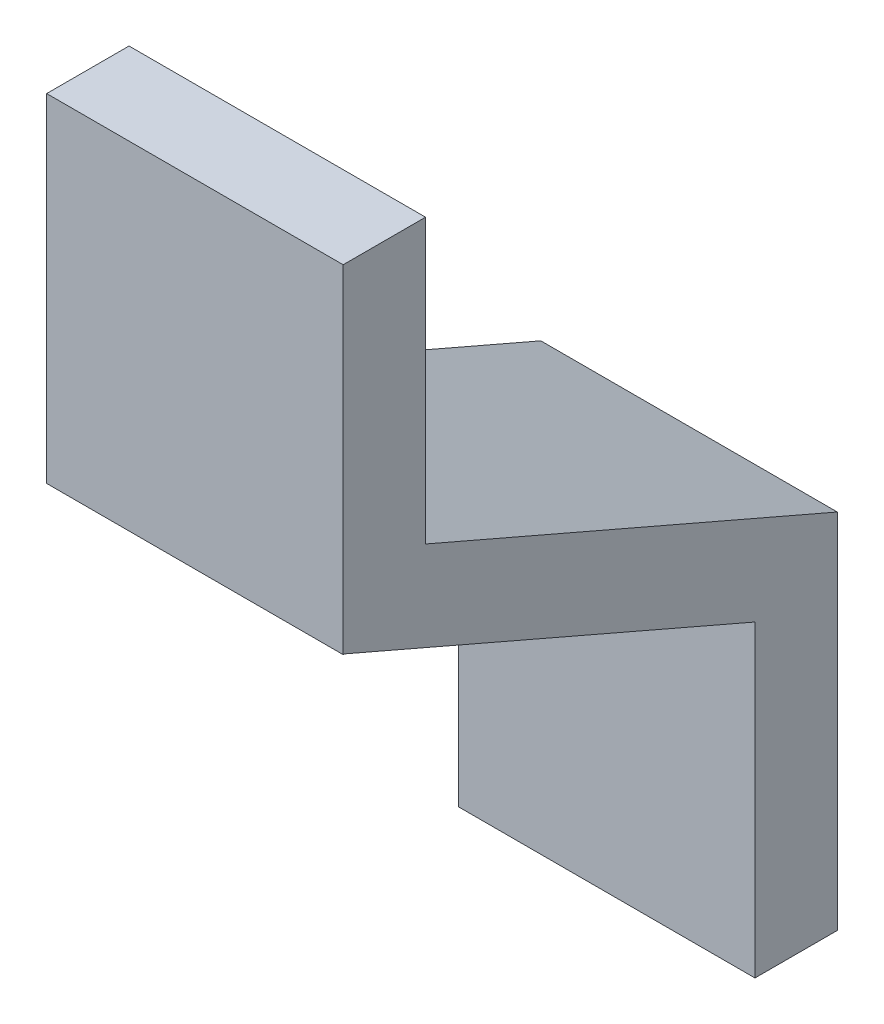
ISO-10303-21;
HEADER;
FILE_DESCRIPTION(('STEP AP214'),'2;1');
FILE_NAME('part.step','',(''),(''),'','','');
FILE_SCHEMA(('AUTOMOTIVE_DESIGN { 1 0 10303 214 1 1 1 1 }'));
ENDSEC;
DATA;
#1=APPLICATION_CONTEXT('core data for automotive mechanical design processes');
#2=APPLICATION_PROTOCOL_DEFINITION('international standard','automotive_design',2000,#1);
#3=PRODUCT_CONTEXT('',#1,'mechanical');
#4=PRODUCT('Part','Part','',(#3));
#5=PRODUCT_RELATED_PRODUCT_CATEGORY('part','',(#4));
#6=PRODUCT_DEFINITION_FORMATION('','',#4);
#7=PRODUCT_DEFINITION_CONTEXT('part definition',#1,'design');
#8=PRODUCT_DEFINITION('design','',#6,#7);
#9=PRODUCT_DEFINITION_SHAPE('','',#8);
#10=(LENGTH_UNIT() NAMED_UNIT(*) SI_UNIT(.MILLI.,.METRE.));
#11=(NAMED_UNIT(*) PLANE_ANGLE_UNIT() SI_UNIT($,.RADIAN.));
#12=(NAMED_UNIT(*) SI_UNIT($,.STERADIAN.) SOLID_ANGLE_UNIT());
#13=UNCERTAINTY_MEASURE_WITH_UNIT(LENGTH_MEASURE(1.E-05),#10,'distance_accuracy_value','');
#14=(GEOMETRIC_REPRESENTATION_CONTEXT(3) GLOBAL_UNCERTAINTY_ASSIGNED_CONTEXT((#13)) GLOBAL_UNIT_ASSIGNED_CONTEXT((#10,
#11,#12)) REPRESENTATION_CONTEXT('',''));
#15=CARTESIAN_POINT('',(0.,0.,0.));
#16=DIRECTION('',(0.,0.,1.));
#17=DIRECTION('',(1.,0.,0.));
#18=AXIS2_PLACEMENT_3D('',#15,#16,#17);
#19=CARTESIAN_POINT('',(2.62,0.999999996424,0.5));
#20=DIRECTION('',(0.,1.,0.));
#21=DIRECTION('',(0.,0.,1.));
#22=AXIS2_PLACEMENT_3D('',#19,#20,#21);
#23=PLANE('',#22);
#24=DIRECTION('',(1.,0.,0.));
#25=VECTOR('',#24,1.);
#26=CARTESIAN_POINT('',(2.62,0.999999996424,0.5));
#27=LINE('',#26,#25);
#28=CARTESIAN_POINT('',(2.980000014305,0.999999996424,0.5));
#29=VERTEX_POINT('',#28);
#30=CARTESIAN_POINT('',(2.62,0.999999996424,0.5));
#31=VERTEX_POINT('',#30);
#32=EDGE_CURVE('E140',#29,#31,#27,.F.);
#33=ORIENTED_EDGE('',*,*,#32,.T.);
#34=DIRECTION('',(0.,0.,-1.));
#35=VECTOR('',#34,1.);
#36=CARTESIAN_POINT('',(2.62,0.999999996424,0.));
#37=LINE('',#36,#35);
#38=CARTESIAN_POINT('',(2.62,0.999999996424,0.60000000149));
#39=VERTEX_POINT('',#38);
#40=EDGE_CURVE('E133',#31,#39,#37,.F.);
#41=ORIENTED_EDGE('',*,*,#40,.T.);
#42=DIRECTION('',(1.,0.,0.));
#43=VECTOR('',#42,1.);
#44=CARTESIAN_POINT('',(2.62,0.999999996424,0.60000000149));
#45=LINE('',#44,#43);
#46=CARTESIAN_POINT('',(2.980000014305,0.999999996424,0.60000000149));
#47=VERTEX_POINT('',#46);
#48=EDGE_CURVE('E129',#47,#39,#45,.F.);
#49=ORIENTED_EDGE('',*,*,#48,.F.);
#50=DIRECTION('',(0.,0.,-1.));
#51=VECTOR('',#50,1.);
#52=CARTESIAN_POINT('',(2.980000014305,0.999999996424,0.));
#53=LINE('',#52,#51);
#54=EDGE_CURVE('E106',#29,#47,#53,.F.);
#55=ORIENTED_EDGE('',*,*,#54,.F.);
#56=EDGE_LOOP('',(#33,#41,#49,#55));
#57=FACE_BOUND('',#56,.T.);
#58=ADVANCED_FACE('F17',(#57),#23,.T.);
#59=CARTESIAN_POINT('',(2.62,0.59,0.60000000149));
#60=DIRECTION('',(0.,0.,1.));
#61=DIRECTION('',(1.,0.,0.));
#62=AXIS2_PLACEMENT_3D('',#59,#60,#61);
#63=PLANE('',#62);
#64=DIRECTION('',(0.,1.,0.));
#65=VECTOR('',#64,1.);
#66=CARTESIAN_POINT('',(2.62,0.44,0.60000000149));
#67=LINE('',#66,#65);
#68=CARTESIAN_POINT('',(2.62,0.59,0.60000000149));
#69=VERTEX_POINT('',#68);
#70=EDGE_CURVE('E136',#39,#69,#67,.F.);
#71=ORIENTED_EDGE('',*,*,#70,.T.);
#72=DIRECTION('',(1.,0.,0.));
#73=VECTOR('',#72,1.);
#74=CARTESIAN_POINT('',(2.62,0.59,0.60000000149));
#75=LINE('',#74,#73);
#76=CARTESIAN_POINT('',(2.980000014305,0.59,0.60000000149));
#77=VERTEX_POINT('',#76);
#78=EDGE_CURVE('E92',#69,#77,#75,.T.);
#79=ORIENTED_EDGE('',*,*,#78,.T.);
#80=DIRECTION('',(0.,1.,0.));
#81=VECTOR('',#80,1.);
#82=CARTESIAN_POINT('',(2.980000014305,0.44,0.60000000149));
#83=LINE('',#82,#81);
#84=EDGE_CURVE('E73',#47,#77,#83,.F.);
#85=ORIENTED_EDGE('',*,*,#84,.F.);
#86=ORIENTED_EDGE('',*,*,#48,.T.);
#87=EDGE_LOOP('',(#71,#79,#85,#86));
#88=FACE_BOUND('',#87,.T.);
#89=ADVANCED_FACE('F285',(#88),#63,.T.);
#90=CARTESIAN_POINT('',(2.62,0.59,0.5));
#91=DIRECTION('',(0.,1.,0.));
#92=DIRECTION('',(0.,0.,1.));
#93=AXIS2_PLACEMENT_3D('',#90,#91,#92);
#94=PLANE('',#93);
#95=DIRECTION('',(1.,0.,0.));
#96=VECTOR('',#95,1.);
#97=CARTESIAN_POINT('',(2.62,0.590000000000416,0.59842599626982));
#98=LINE('',#97,#96);
#99=CARTESIAN_POINT('',(2.980000014305,0.590000000000104,0.598425996269911));
#100=VERTEX_POINT('',#99);
#101=CARTESIAN_POINT('',(2.62,0.590000000000104,0.59842599626991));
#102=VERTEX_POINT('',#101);
#103=EDGE_CURVE('E84',#100,#102,#98,.F.);
#104=ORIENTED_EDGE('',*,*,#103,.F.);
#105=DIRECTION('',(0.,0.,-1.));
#106=VECTOR('',#105,1.);
#107=CARTESIAN_POINT('',(2.980000014305,0.59,0.));
#108=LINE('',#107,#106);
#109=EDGE_CURVE('E20',#77,#100,#108,.T.);
#110=ORIENTED_EDGE('',*,*,#109,.F.);
#111=ORIENTED_EDGE('',*,*,#78,.F.);
#112=DIRECTION('',(0.,0.,1.));
#113=VECTOR('',#112,1.);
#114=CARTESIAN_POINT('',(2.62,0.59,0.5));
#115=LINE('',#114,#113);
#116=EDGE_CURVE('E87',#69,#102,#115,.F.);
#117=ORIENTED_EDGE('',*,*,#116,.T.);
#118=EDGE_LOOP('',(#104,#110,#111,#117));
#119=FACE_BOUND('',#118,.T.);
#120=ADVANCED_FACE('F85',(#119),#94,.F.);
#121=CARTESIAN_POINT('',(2.62,0.348224508223,0.03971472531736));
#122=DIRECTION('',(0.,-0.917754904098641,0.397147247255844));
#123=DIRECTION('',(0.,-0.397147247255844,-0.917754904098641));
#124=AXIS2_PLACEMENT_3D('',#121,#122,#123);
#125=PLANE('',#124);
#126=DIRECTION('',(0.,-0.397147247255413,-0.917754904098827));
#127=VECTOR('',#126,1.);
#128=CARTESIAN_POINT('',(2.980000014305,0.59,0.59842599627));
#129=LINE('',#128,#127);
#130=CARTESIAN_POINT('',(2.980000014305,0.37431222660502,0.10000000149));
#131=VERTEX_POINT('',#130);
#132=EDGE_CURVE('E80',#100,#131,#129,.T.);
#133=ORIENTED_EDGE('',*,*,#132,.F.);
#134=ORIENTED_EDGE('',*,*,#103,.T.);
#135=DIRECTION('',(0.,-0.397147247255413,-0.917754904098827));
#136=VECTOR('',#135,1.);
#137=CARTESIAN_POINT('',(2.62,0.59,0.59842599627));
#138=LINE('',#137,#136);
#139=CARTESIAN_POINT('',(2.62,0.374312226605,0.10000000149));
#140=VERTEX_POINT('',#139);
#141=EDGE_CURVE('E122',#102,#140,#138,.T.);
#142=ORIENTED_EDGE('',*,*,#141,.T.);
#143=DIRECTION('',(1.,0.,0.));
#144=VECTOR('',#143,1.);
#145=CARTESIAN_POINT('',(2.62,0.374312226605,0.10000000149));
#146=LINE('',#145,#144);
#147=EDGE_CURVE('E91',#131,#140,#146,.F.);
#148=ORIENTED_EDGE('',*,*,#147,.F.);
#149=EDGE_LOOP('',(#133,#134,#142,#148));
#150=FACE_BOUND('',#149,.T.);
#151=ADVANCED_FACE('F94',(#150),#125,.T.);
#152=CARTESIAN_POINT('',(2.62,0.,0.10000000149));
#153=DIRECTION('',(0.,0.,1.));
#154=DIRECTION('',(1.,0.,0.));
#155=AXIS2_PLACEMENT_3D('',#152,#153,#154);
#156=PLANE('',#155);
#157=ORIENTED_EDGE('',*,*,#147,.T.);
#158=DIRECTION('',(0.,1.,0.));
#159=VECTOR('',#158,1.);
#160=CARTESIAN_POINT('',(2.62,0.44,0.10000000149));
#161=LINE('',#160,#159);
#162=CARTESIAN_POINT('',(2.62,0.,0.10000000149));
#163=VERTEX_POINT('',#162);
#164=EDGE_CURVE('E118',#140,#163,#161,.F.);
#165=ORIENTED_EDGE('',*,*,#164,.T.);
#166=DIRECTION('',(1.,0.,0.));
#167=VECTOR('',#166,1.);
#168=CARTESIAN_POINT('',(2.62,0.,0.10000000149));
#169=LINE('',#168,#167);
#170=CARTESIAN_POINT('',(2.980000014305,0.,0.10000000149));
#171=VERTEX_POINT('',#170);
#172=EDGE_CURVE('E115',#163,#171,#169,.T.);
#173=ORIENTED_EDGE('',*,*,#172,.T.);
#174=DIRECTION('',(0.,1.,0.));
#175=VECTOR('',#174,1.);
#176=CARTESIAN_POINT('',(2.980000014305,0.44,0.10000000149));
#177=LINE('',#176,#175);
#178=EDGE_CURVE('E96',#131,#171,#177,.F.);
#179=ORIENTED_EDGE('',*,*,#178,.F.);
#180=EDGE_LOOP('',(#157,#165,#173,#179));
#181=FACE_BOUND('',#180,.T.);
#182=ADVANCED_FACE('F202',(#181),#156,.T.);
#183=CARTESIAN_POINT('',(2.62,0.,0.));
#184=DIRECTION('',(0.,1.,0.));
#185=DIRECTION('',(0.,0.,1.));
#186=AXIS2_PLACEMENT_3D('',#183,#184,#185);
#187=PLANE('',#186);
#188=DIRECTION('',(0.,0.,-1.));
#189=VECTOR('',#188,1.);
#190=CARTESIAN_POINT('',(2.62,0.,0.));
#191=LINE('',#190,#189);
#192=CARTESIAN_POINT('',(2.62,0.,0.));
#193=VERTEX_POINT('',#192);
#194=EDGE_CURVE('E121',#163,#193,#191,.T.);
#195=ORIENTED_EDGE('',*,*,#194,.T.);
#196=DIRECTION('',(1.,0.,0.));
#197=VECTOR('',#196,1.);
#198=CARTESIAN_POINT('',(2.62,0.,0.));
#199=LINE('',#198,#197);
#200=CARTESIAN_POINT('',(2.980000014305,0.,0.));
#201=VERTEX_POINT('',#200);
#202=EDGE_CURVE('E112',#193,#201,#199,.T.);
#203=ORIENTED_EDGE('',*,*,#202,.T.);
#204=DIRECTION('',(0.,0.,-1.));
#205=VECTOR('',#204,1.);
#206=CARTESIAN_POINT('',(2.980000014305,0.,0.));
#207=LINE('',#206,#205);
#208=EDGE_CURVE('E98',#171,#201,#207,.T.);
#209=ORIENTED_EDGE('',*,*,#208,.F.);
#210=ORIENTED_EDGE('',*,*,#172,.F.);
#211=EDGE_LOOP('',(#195,#203,#209,#210));
#212=FACE_BOUND('',#211,.T.);
#213=ADVANCED_FACE('F206',(#212),#187,.F.);
#214=CARTESIAN_POINT('',(2.62,0.,0.));
#215=DIRECTION('',(0.,0.,1.));
#216=DIRECTION('',(1.,0.,0.));
#217=AXIS2_PLACEMENT_3D('',#214,#215,#216);
#218=PLANE('',#217);
#219=ORIENTED_EDGE('',*,*,#202,.F.);
#220=DIRECTION('',(0.,1.,0.));
#221=VECTOR('',#220,1.);
#222=CARTESIAN_POINT('',(2.62,0.44,0.));
#223=LINE('',#222,#221);
#224=CARTESIAN_POINT('',(2.62,0.439999998997445,-1.94673175919965E-10));
#225=VERTEX_POINT('',#224);
#226=EDGE_CURVE('E178',#193,#225,#223,.T.);
#227=ORIENTED_EDGE('',*,*,#226,.T.);
#228=DIRECTION('',(1.,0.,0.));
#229=VECTOR('',#228,1.);
#230=CARTESIAN_POINT('',(2.62,0.43999999966303,-7.78692710220355E-10));
#231=LINE('',#230,#229);
#232=CARTESIAN_POINT('',(2.980000014305,0.439999998997445,-1.94673175919965E-10));
#233=VERTEX_POINT('',#232);
#234=EDGE_CURVE('E163',#225,#233,#231,.T.);
#235=ORIENTED_EDGE('',*,*,#234,.T.);
#236=DIRECTION('',(0.,1.,0.));
#237=VECTOR('',#236,1.);
#238=CARTESIAN_POINT('',(2.980000014305,0.44,0.));
#239=LINE('',#238,#237);
#240=EDGE_CURVE('E109',#201,#233,#239,.T.);
#241=ORIENTED_EDGE('',*,*,#240,.F.);
#242=EDGE_LOOP('',(#219,#227,#235,#241));
#243=FACE_BOUND('',#242,.T.);
#244=ADVANCED_FACE('F186',(#243),#218,.F.);
#245=CARTESIAN_POINT('',(2.980000014305,0.44,0.));
#246=DIRECTION('',(1.,0.,0.));
#247=DIRECTION('',(0.,0.,-1.));
#248=AXIS2_PLACEMENT_3D('',#245,#246,#247);
#249=PLANE('',#248);
#250=ORIENTED_EDGE('',*,*,#178,.T.);
#251=ORIENTED_EDGE('',*,*,#208,.T.);
#252=ORIENTED_EDGE('',*,*,#240,.T.);
#253=DIRECTION('',(0.,-0.397147247255844,-0.917754904098641));
#254=VECTOR('',#253,1.);
#255=CARTESIAN_POINT('',(2.980000014305,0.44,0.));
#256=LINE('',#255,#254);
#257=CARTESIAN_POINT('',(2.980000014305,0.656368904967003,0.499999999999999));
#258=VERTEX_POINT('',#257);
#259=EDGE_CURVE('E151',#233,#258,#256,.F.);
#260=ORIENTED_EDGE('',*,*,#259,.T.);
#261=DIRECTION('',(0.,1.,0.));
#262=VECTOR('',#261,1.);
#263=CARTESIAN_POINT('',(2.980000014305,0.59,0.5));
#264=LINE('',#263,#262);
#265=EDGE_CURVE('E144',#258,#29,#264,.T.);
#266=ORIENTED_EDGE('',*,*,#265,.T.);
#267=ORIENTED_EDGE('',*,*,#54,.T.);
#268=ORIENTED_EDGE('',*,*,#84,.T.);
#269=ORIENTED_EDGE('',*,*,#109,.T.);
#270=ORIENTED_EDGE('',*,*,#132,.T.);
#271=EDGE_LOOP('',(#250,#251,#252,#260,#266,#267,#268,#269,#270));
#272=FACE_BOUND('',#271,.T.);
#273=ADVANCED_FACE('F78',(#272),#249,.T.);
#274=CARTESIAN_POINT('',(2.62,0.59,0.5));
#275=DIRECTION('',(0.,0.,1.));
#276=DIRECTION('',(1.,0.,0.));
#277=AXIS2_PLACEMENT_3D('',#274,#275,#276);
#278=PLANE('',#277);
#279=ORIENTED_EDGE('',*,*,#265,.F.);
#280=DIRECTION('',(1.,0.,0.));
#281=VECTOR('',#280,1.);
#282=CARTESIAN_POINT('',(2.62,0.656368904967005,0.499999999999998));
#283=LINE('',#282,#281);
#284=CARTESIAN_POINT('',(2.62,0.656368904967001,0.5));
#285=VERTEX_POINT('',#284);
#286=EDGE_CURVE('E26',#258,#285,#283,.F.);
#287=ORIENTED_EDGE('',*,*,#286,.T.);
#288=DIRECTION('',(0.,1.,0.));
#289=VECTOR('',#288,1.);
#290=CARTESIAN_POINT('',(2.62,0.44,0.5));
#291=LINE('',#290,#289);
#292=EDGE_CURVE('E34',#285,#31,#291,.T.);
#293=ORIENTED_EDGE('',*,*,#292,.T.);
#294=ORIENTED_EDGE('',*,*,#32,.F.);
#295=EDGE_LOOP('',(#279,#287,#293,#294));
#296=FACE_BOUND('',#295,.T.);
#297=ADVANCED_FACE('F212',(#296),#278,.F.);
#298=CARTESIAN_POINT('',(2.62,0.44,0.));
#299=DIRECTION('',(1.,0.,0.));
#300=DIRECTION('',(0.,0.,-1.));
#301=AXIS2_PLACEMENT_3D('',#298,#299,#300);
#302=PLANE('',#301);
#303=ORIENTED_EDGE('',*,*,#226,.F.);
#304=ORIENTED_EDGE('',*,*,#194,.F.);
#305=ORIENTED_EDGE('',*,*,#164,.F.);
#306=ORIENTED_EDGE('',*,*,#141,.F.);
#307=ORIENTED_EDGE('',*,*,#116,.F.);
#308=ORIENTED_EDGE('',*,*,#70,.F.);
#309=ORIENTED_EDGE('',*,*,#40,.F.);
#310=ORIENTED_EDGE('',*,*,#292,.F.);
#311=DIRECTION('',(0.,-0.397147247255844,-0.917754904098641));
#312=VECTOR('',#311,1.);
#313=CARTESIAN_POINT('',(2.62,0.44,0.));
#314=LINE('',#313,#312);
#315=EDGE_CURVE('E11',#285,#225,#314,.T.);
#316=ORIENTED_EDGE('',*,*,#315,.T.);
#317=EDGE_LOOP('',(#303,#304,#305,#306,#307,#308,#309,#310,#316));
#318=FACE_BOUND('',#317,.T.);
#319=ADVANCED_FACE('F207',(#318),#302,.F.);
#320=CARTESIAN_POINT('',(2.62,0.44,0.));
#321=DIRECTION('',(0.,-0.917754904098641,0.397147247255844));
#322=DIRECTION('',(0.,-0.397147247255844,-0.917754904098641));
#323=AXIS2_PLACEMENT_3D('',#320,#321,#322);
#324=PLANE('',#323);
#325=ORIENTED_EDGE('',*,*,#286,.F.);
#326=ORIENTED_EDGE('',*,*,#259,.F.);
#327=ORIENTED_EDGE('',*,*,#234,.F.);
#328=ORIENTED_EDGE('',*,*,#315,.F.);
#329=EDGE_LOOP('',(#325,#326,#327,#328));
#330=FACE_BOUND('',#329,.T.);
#331=ADVANCED_FACE('F193',(#330),#324,.F.);
#332=CLOSED_SHELL('',(#58,#89,#120,#151,#182,#213,#244,#273,#297,#319,#331));
#333=MANIFOLD_SOLID_BREP('B1',#332);
#334=ADVANCED_BREP_SHAPE_REPRESENTATION('',(#18,#333),#14);
#335=SHAPE_DEFINITION_REPRESENTATION(#9,#334);
ENDSEC;
END-ISO-10303-21;
